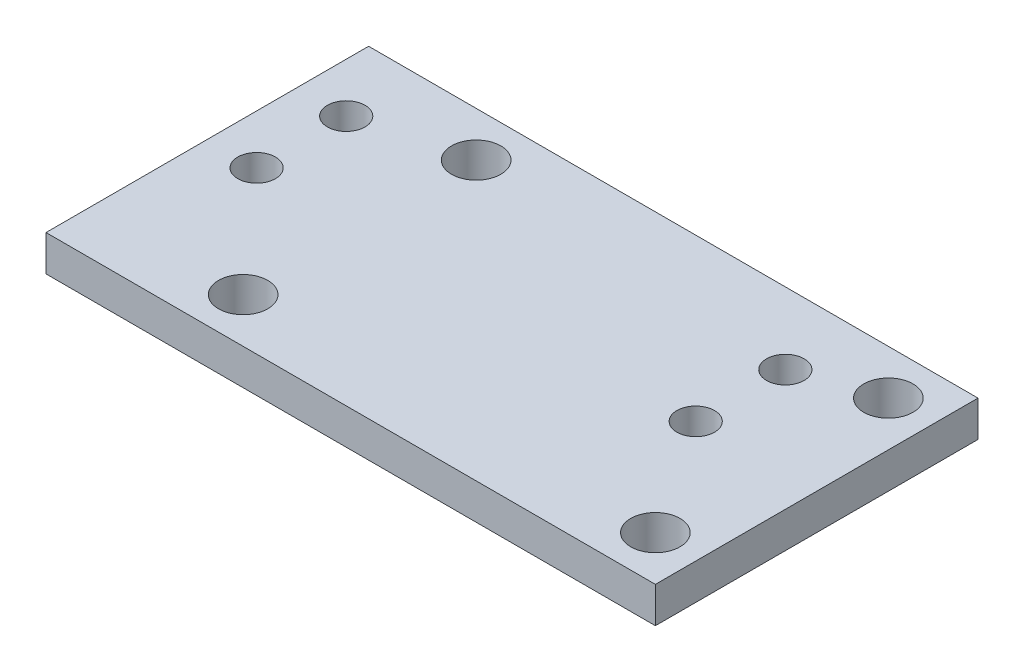
ISO-10303-21;
HEADER;
FILE_DESCRIPTION(('STEP AP214'),'2;1');
FILE_NAME('part.step','',(''),(''),'','','');
FILE_SCHEMA(('AUTOMOTIVE_DESIGN { 1 0 10303 214 1 1 1 1 }'));
ENDSEC;
DATA;
#1=APPLICATION_CONTEXT('core data for automotive mechanical design processes');
#2=APPLICATION_PROTOCOL_DEFINITION('international standard','automotive_design',2000,#1);
#3=PRODUCT_CONTEXT('',#1,'mechanical');
#4=PRODUCT('Part','Part','',(#3));
#5=PRODUCT_RELATED_PRODUCT_CATEGORY('part','',(#4));
#6=PRODUCT_DEFINITION_FORMATION('','',#4);
#7=PRODUCT_DEFINITION_CONTEXT('part definition',#1,'design');
#8=PRODUCT_DEFINITION('design','',#6,#7);
#9=PRODUCT_DEFINITION_SHAPE('','',#8);
#10=(LENGTH_UNIT() NAMED_UNIT(*) SI_UNIT(.MILLI.,.METRE.));
#11=(NAMED_UNIT(*) PLANE_ANGLE_UNIT() SI_UNIT($,.RADIAN.));
#12=(NAMED_UNIT(*) SI_UNIT($,.STERADIAN.) SOLID_ANGLE_UNIT());
#13=UNCERTAINTY_MEASURE_WITH_UNIT(LENGTH_MEASURE(1.E-05),#10,'distance_accuracy_value','');
#14=(GEOMETRIC_REPRESENTATION_CONTEXT(3) GLOBAL_UNCERTAINTY_ASSIGNED_CONTEXT((#13)) GLOBAL_UNIT_ASSIGNED_CONTEXT((#10,
#11,#12)) REPRESENTATION_CONTEXT('',''));
#15=CARTESIAN_POINT('',(0.,0.,0.));
#16=DIRECTION('',(0.,0.,1.));
#17=DIRECTION('',(1.,0.,0.));
#18=AXIS2_PLACEMENT_3D('',#15,#16,#17);
#19=CARTESIAN_POINT('',(0.,4.,0.));
#20=DIRECTION('',(0.,1.,0.));
#21=DIRECTION('',(0.,0.,1.));
#22=AXIS2_PLACEMENT_3D('',#19,#20,#21);
#23=PLANE('',#22);
#24=CARTESIAN_POINT('',(-41.4190774454018,4.,-24.4811588588684));
#25=DIRECTION('',(0.,1.,0.));
#26=DIRECTION('',(0.,0.,1.));
#27=AXIS2_PLACEMENT_3D('',#24,#25,#26);
#28=CIRCLE('',#27,2.1);
#29=CARTESIAN_POINT('',(-41.4190774454018,4.,-22.3811588588684));
#30=VERTEX_POINT('',#29);
#31=EDGE_CURVE('E195',#30,#30,#28,.T.);
#32=ORIENTED_EDGE('',*,*,#31,.F.);
#33=EDGE_LOOP('',(#32));
#34=FACE_BOUND('',#33,.T.);
#35=CARTESIAN_POINT('',(7.58092255459818,4.,-14.4811588588684));
#36=DIRECTION('',(0.,1.,0.));
#37=DIRECTION('',(0.,0.,1.));
#38=AXIS2_PLACEMENT_3D('',#35,#36,#37);
#39=CIRCLE('',#38,2.1);
#40=CARTESIAN_POINT('',(7.58092255459818,4.,-12.3811588588684));
#41=VERTEX_POINT('',#40);
#42=EDGE_CURVE('E211',#41,#41,#39,.T.);
#43=ORIENTED_EDGE('',*,*,#42,.F.);
#44=EDGE_LOOP('',(#43));
#45=FACE_BOUND('',#44,.T.);
#46=CARTESIAN_POINT('',(-29.9190774454018,4.,-1.48115885886842));
#47=DIRECTION('',(0.,1.,0.));
#48=DIRECTION('',(0.,0.,1.));
#49=AXIS2_PLACEMENT_3D('',#46,#47,#48);
#50=CIRCLE('',#49,2.75);
#51=CARTESIAN_POINT('',(-29.9190774454018,4.,1.26884114113158));
#52=VERTEX_POINT('',#51);
#53=EDGE_CURVE('E227',#52,#52,#50,.T.);
#54=ORIENTED_EDGE('',*,*,#53,.F.);
#55=EDGE_LOOP('',(#54));
#56=FACE_BOUND('',#55,.T.);
#57=CARTESIAN_POINT('',(-29.9190774454018,4.,-27.4811588588684));
#58=DIRECTION('',(0.,1.,0.));
#59=DIRECTION('',(0.,0.,1.));
#60=AXIS2_PLACEMENT_3D('',#57,#58,#59);
#61=CIRCLE('',#60,2.75);
#62=CARTESIAN_POINT('',(-29.9190774454018,4.,-24.7311588588684));
#63=VERTEX_POINT('',#62);
#64=EDGE_CURVE('E115',#63,#63,#61,.T.);
#65=ORIENTED_EDGE('',*,*,#64,.F.);
#66=EDGE_LOOP('',(#65));
#67=FACE_BOUND('',#66,.T.);
#68=DIRECTION('',(-1.,0.,0.));
#69=VECTOR('',#68,1.);
#70=CARTESIAN_POINT('',(-34.9190774454018,4.,-32.4811588588684));
#71=LINE('',#70,#69);
#72=CARTESIAN_POINT('',(21.0809225545982,4.,-32.4811588588684));
#73=VERTEX_POINT('',#72);
#74=CARTESIAN_POINT('',(-46.9190774454018,4.,-32.4811588588684));
#75=VERTEX_POINT('',#74);
#76=EDGE_CURVE('E61',#73,#75,#71,.T.);
#77=ORIENTED_EDGE('',*,*,#76,.T.);
#78=DIRECTION('',(0.,0.,1.));
#79=VECTOR('',#78,1.);
#80=CARTESIAN_POINT('',(-46.9190774454018,4.,-32.4811588588684));
#81=LINE('',#80,#79);
#82=CARTESIAN_POINT('',(-46.9190774454018,4.,3.51884114113159));
#83=VERTEX_POINT('',#82);
#84=EDGE_CURVE('E91',#75,#83,#81,.T.);
#85=ORIENTED_EDGE('',*,*,#84,.T.);
#86=DIRECTION('',(1.,0.,0.));
#87=VECTOR('',#86,1.);
#88=CARTESIAN_POINT('',(-46.9190774454018,4.,3.51884114113159));
#89=LINE('',#88,#87);
#90=CARTESIAN_POINT('',(21.0809225545982,4.,3.51884114113159));
#91=VERTEX_POINT('',#90);
#92=EDGE_CURVE('E95',#83,#91,#89,.T.);
#93=ORIENTED_EDGE('',*,*,#92,.T.);
#94=DIRECTION('',(0.,0.,-1.));
#95=VECTOR('',#94,1.);
#96=CARTESIAN_POINT('',(21.0809225545982,4.,-32.4811588588684));
#97=LINE('',#96,#95);
#98=EDGE_CURVE('E106',#91,#73,#97,.T.);
#99=ORIENTED_EDGE('',*,*,#98,.T.);
#100=EDGE_LOOP('',(#77,#85,#93,#99));
#101=FACE_BOUND('',#100,.T.);
#102=CARTESIAN_POINT('',(16.0809225545982,4.,-27.4811588588684));
#103=DIRECTION('',(0.,1.,0.));
#104=DIRECTION('',(0.,0.,1.));
#105=AXIS2_PLACEMENT_3D('',#102,#103,#104);
#106=CIRCLE('',#105,2.75);
#107=CARTESIAN_POINT('',(16.0809225545982,4.,-24.7311588588684));
#108=VERTEX_POINT('',#107);
#109=EDGE_CURVE('E235',#108,#108,#106,.T.);
#110=ORIENTED_EDGE('',*,*,#109,.F.);
#111=EDGE_LOOP('',(#110));
#112=FACE_BOUND('',#111,.T.);
#113=CARTESIAN_POINT('',(16.0809225545982,4.,-1.48115885886842));
#114=DIRECTION('',(0.,1.,0.));
#115=DIRECTION('',(0.,0.,1.));
#116=AXIS2_PLACEMENT_3D('',#113,#114,#115);
#117=CIRCLE('',#116,2.75);
#118=CARTESIAN_POINT('',(16.0809225545982,4.,1.26884114113157));
#119=VERTEX_POINT('',#118);
#120=EDGE_CURVE('E219',#119,#119,#117,.T.);
#121=ORIENTED_EDGE('',*,*,#120,.F.);
#122=EDGE_LOOP('',(#121));
#123=FACE_BOUND('',#122,.T.);
#124=CARTESIAN_POINT('',(7.58092255459818,4.,-24.4811588588684));
#125=DIRECTION('',(0.,1.,0.));
#126=DIRECTION('',(0.,0.,1.));
#127=AXIS2_PLACEMENT_3D('',#124,#125,#126);
#128=CIRCLE('',#127,2.1);
#129=CARTESIAN_POINT('',(7.58092255459818,4.,-22.3811588588684));
#130=VERTEX_POINT('',#129);
#131=EDGE_CURVE('E203',#130,#130,#128,.T.);
#132=ORIENTED_EDGE('',*,*,#131,.F.);
#133=EDGE_LOOP('',(#132));
#134=FACE_BOUND('',#133,.T.);
#135=CARTESIAN_POINT('',(-41.4190774454018,4.,-14.4811588588684));
#136=DIRECTION('',(0.,1.,0.));
#137=DIRECTION('',(0.,0.,1.));
#138=AXIS2_PLACEMENT_3D('',#135,#136,#137);
#139=CIRCLE('',#138,2.1);
#140=CARTESIAN_POINT('',(-41.4190774454018,4.,-12.3811588588684));
#141=VERTEX_POINT('',#140);
#142=EDGE_CURVE('E184',#141,#141,#139,.T.);
#143=ORIENTED_EDGE('',*,*,#142,.F.);
#144=EDGE_LOOP('',(#143));
#145=FACE_BOUND('',#144,.T.);
#146=ADVANCED_FACE('F43',(#34,#45,#56,#67,#101,#112,#123,#134,#145),#23,.T.);
#147=CARTESIAN_POINT('',(0.,0.,0.));
#148=DIRECTION('',(0.,1.,0.));
#149=DIRECTION('',(0.,0.,1.));
#150=AXIS2_PLACEMENT_3D('',#147,#148,#149);
#151=PLANE('',#150);
#152=DIRECTION('',(0.,0.,1.));
#153=VECTOR('',#152,1.);
#154=CARTESIAN_POINT('',(-46.9190774454018,0.,-32.4811588588684));
#155=LINE('',#154,#153);
#156=CARTESIAN_POINT('',(-46.9190774454018,0.,-32.4811588588684));
#157=VERTEX_POINT('',#156);
#158=CARTESIAN_POINT('',(-46.9190774454018,0.,3.51884114113159));
#159=VERTEX_POINT('',#158);
#160=EDGE_CURVE('E100',#157,#159,#155,.T.);
#161=ORIENTED_EDGE('',*,*,#160,.F.);
#162=DIRECTION('',(-1.,0.,0.));
#163=VECTOR('',#162,1.);
#164=CARTESIAN_POINT('',(-34.9190774454018,0.,-32.4811588588684));
#165=LINE('',#164,#163);
#166=CARTESIAN_POINT('',(21.0809225545982,0.,-32.4811588588684));
#167=VERTEX_POINT('',#166);
#168=EDGE_CURVE('E120',#167,#157,#165,.T.);
#169=ORIENTED_EDGE('',*,*,#168,.F.);
#170=DIRECTION('',(0.,0.,-1.));
#171=VECTOR('',#170,1.);
#172=CARTESIAN_POINT('',(21.0809225545982,0.,-32.4811588588684));
#173=LINE('',#172,#171);
#174=CARTESIAN_POINT('',(21.0809225545982,0.,3.51884114113159));
#175=VERTEX_POINT('',#174);
#176=EDGE_CURVE('E85',#175,#167,#173,.T.);
#177=ORIENTED_EDGE('',*,*,#176,.F.);
#178=DIRECTION('',(1.,0.,0.));
#179=VECTOR('',#178,1.);
#180=CARTESIAN_POINT('',(-34.9190774454018,0.,3.51884114113159));
#181=LINE('',#180,#179);
#182=EDGE_CURVE('E78',#159,#175,#181,.T.);
#183=ORIENTED_EDGE('',*,*,#182,.F.);
#184=EDGE_LOOP('',(#161,#169,#177,#183));
#185=FACE_BOUND('',#184,.T.);
#186=CARTESIAN_POINT('',(-29.9190774454018,0.,-27.4811588588684));
#187=DIRECTION('',(0.,1.,0.));
#188=DIRECTION('',(0.,0.,1.));
#189=AXIS2_PLACEMENT_3D('',#186,#187,#188);
#190=CIRCLE('',#189,2.75);
#191=CARTESIAN_POINT('',(-29.9190774454018,0.,-24.7311588588684));
#192=VERTEX_POINT('',#191);
#193=EDGE_CURVE('E239',#192,#192,#190,.T.);
#194=ORIENTED_EDGE('',*,*,#193,.T.);
#195=EDGE_LOOP('',(#194));
#196=FACE_BOUND('',#195,.T.);
#197=CARTESIAN_POINT('',(16.0809225545982,0.,-27.4811588588684));
#198=DIRECTION('',(0.,1.,0.));
#199=DIRECTION('',(0.,0.,1.));
#200=AXIS2_PLACEMENT_3D('',#197,#198,#199);
#201=CIRCLE('',#200,2.75);
#202=CARTESIAN_POINT('',(16.0809225545982,0.,-24.7311588588684));
#203=VERTEX_POINT('',#202);
#204=EDGE_CURVE('E231',#203,#203,#201,.T.);
#205=ORIENTED_EDGE('',*,*,#204,.T.);
#206=EDGE_LOOP('',(#205));
#207=FACE_BOUND('',#206,.T.);
#208=CARTESIAN_POINT('',(-29.9190774454018,0.,-1.48115885886842));
#209=DIRECTION('',(0.,1.,0.));
#210=DIRECTION('',(0.,0.,1.));
#211=AXIS2_PLACEMENT_3D('',#208,#209,#210);
#212=CIRCLE('',#211,2.75);
#213=CARTESIAN_POINT('',(-29.9190774454018,0.,1.26884114113158));
#214=VERTEX_POINT('',#213);
#215=EDGE_CURVE('E223',#214,#214,#212,.T.);
#216=ORIENTED_EDGE('',*,*,#215,.T.);
#217=EDGE_LOOP('',(#216));
#218=FACE_BOUND('',#217,.T.);
#219=CARTESIAN_POINT('',(16.0809225545982,0.,-1.48115885886842));
#220=DIRECTION('',(0.,1.,0.));
#221=DIRECTION('',(0.,0.,1.));
#222=AXIS2_PLACEMENT_3D('',#219,#220,#221);
#223=CIRCLE('',#222,2.75);
#224=CARTESIAN_POINT('',(16.0809225545982,0.,1.26884114113157));
#225=VERTEX_POINT('',#224);
#226=EDGE_CURVE('E215',#225,#225,#223,.T.);
#227=ORIENTED_EDGE('',*,*,#226,.T.);
#228=EDGE_LOOP('',(#227));
#229=FACE_BOUND('',#228,.T.);
#230=CARTESIAN_POINT('',(7.58092255459818,0.,-14.4811588588684));
#231=DIRECTION('',(0.,1.,0.));
#232=DIRECTION('',(0.,0.,1.));
#233=AXIS2_PLACEMENT_3D('',#230,#231,#232);
#234=CIRCLE('',#233,2.1);
#235=CARTESIAN_POINT('',(7.58092255459818,0.,-12.3811588588684));
#236=VERTEX_POINT('',#235);
#237=EDGE_CURVE('E207',#236,#236,#234,.T.);
#238=ORIENTED_EDGE('',*,*,#237,.T.);
#239=EDGE_LOOP('',(#238));
#240=FACE_BOUND('',#239,.T.);
#241=CARTESIAN_POINT('',(7.58092255459818,0.,-24.4811588588684));
#242=DIRECTION('',(0.,1.,0.));
#243=DIRECTION('',(0.,0.,1.));
#244=AXIS2_PLACEMENT_3D('',#241,#242,#243);
#245=CIRCLE('',#244,2.1);
#246=CARTESIAN_POINT('',(7.58092255459818,0.,-22.3811588588684));
#247=VERTEX_POINT('',#246);
#248=EDGE_CURVE('E199',#247,#247,#245,.T.);
#249=ORIENTED_EDGE('',*,*,#248,.T.);
#250=EDGE_LOOP('',(#249));
#251=FACE_BOUND('',#250,.T.);
#252=CARTESIAN_POINT('',(-41.4190774454018,0.,-24.4811588588684));
#253=DIRECTION('',(0.,1.,0.));
#254=DIRECTION('',(0.,0.,1.));
#255=AXIS2_PLACEMENT_3D('',#252,#253,#254);
#256=CIRCLE('',#255,2.1);
#257=CARTESIAN_POINT('',(-41.4190774454018,0.,-22.3811588588684));
#258=VERTEX_POINT('',#257);
#259=EDGE_CURVE('E192',#258,#258,#256,.T.);
#260=ORIENTED_EDGE('',*,*,#259,.T.);
#261=EDGE_LOOP('',(#260));
#262=FACE_BOUND('',#261,.T.);
#263=CARTESIAN_POINT('',(-41.4190774454018,0.,-14.4811588588684));
#264=DIRECTION('',(0.,1.,0.));
#265=DIRECTION('',(0.,0.,1.));
#266=AXIS2_PLACEMENT_3D('',#263,#264,#265);
#267=CIRCLE('',#266,2.1);
#268=CARTESIAN_POINT('',(-41.4190774454018,0.,-12.3811588588684));
#269=VERTEX_POINT('',#268);
#270=EDGE_CURVE('E187',#269,#269,#267,.T.);
#271=ORIENTED_EDGE('',*,*,#270,.T.);
#272=EDGE_LOOP('',(#271));
#273=FACE_BOUND('',#272,.T.);
#274=ADVANCED_FACE('F129',(#185,#196,#207,#218,#229,#240,#251,#262,#273),#151,.F.);
#275=CARTESIAN_POINT('',(-46.9190774454018,4.,-32.4811588588684));
#276=DIRECTION('',(1.,0.,0.));
#277=DIRECTION('',(0.,0.,-1.));
#278=AXIS2_PLACEMENT_3D('',#275,#276,#277);
#279=PLANE('',#278);
#280=ORIENTED_EDGE('',*,*,#160,.T.);
#281=DIRECTION('',(0.,-1.,0.));
#282=VECTOR('',#281,1.);
#283=CARTESIAN_POINT('',(-46.9190774454018,4.,3.51884114113159));
#284=LINE('',#283,#282);
#285=EDGE_CURVE('E53',#83,#159,#284,.T.);
#286=ORIENTED_EDGE('',*,*,#285,.F.);
#287=ORIENTED_EDGE('',*,*,#84,.F.);
#288=DIRECTION('',(0.,-1.,0.));
#289=VECTOR('',#288,1.);
#290=CARTESIAN_POINT('',(-46.9190774454018,4.,-32.4811588588684));
#291=LINE('',#290,#289);
#292=EDGE_CURVE('E11',#75,#157,#291,.T.);
#293=ORIENTED_EDGE('',*,*,#292,.T.);
#294=EDGE_LOOP('',(#280,#286,#287,#293));
#295=FACE_BOUND('',#294,.T.);
#296=ADVANCED_FACE('F45',(#295),#279,.F.);
#297=CARTESIAN_POINT('',(-34.9190774454018,4.,3.51884114113159));
#298=DIRECTION('',(0.,0.,-1.));
#299=DIRECTION('',(-1.,0.,0.));
#300=AXIS2_PLACEMENT_3D('',#297,#298,#299);
#301=PLANE('',#300);
#302=ORIENTED_EDGE('',*,*,#182,.T.);
#303=DIRECTION('',(0.,-1.,0.));
#304=VECTOR('',#303,1.);
#305=CARTESIAN_POINT('',(21.0809225545982,4.,3.51884114113159));
#306=LINE('',#305,#304);
#307=EDGE_CURVE('E102',#91,#175,#306,.T.);
#308=ORIENTED_EDGE('',*,*,#307,.F.);
#309=ORIENTED_EDGE('',*,*,#92,.F.);
#310=ORIENTED_EDGE('',*,*,#285,.T.);
#311=EDGE_LOOP('',(#302,#308,#309,#310));
#312=FACE_BOUND('',#311,.T.);
#313=ADVANCED_FACE('F103',(#312),#301,.F.);
#314=CARTESIAN_POINT('',(21.0809225545982,4.,-32.4811588588684));
#315=DIRECTION('',(-1.,0.,0.));
#316=DIRECTION('',(0.,0.,1.));
#317=AXIS2_PLACEMENT_3D('',#314,#315,#316);
#318=PLANE('',#317);
#319=ORIENTED_EDGE('',*,*,#176,.T.);
#320=DIRECTION('',(0.,-1.,0.));
#321=VECTOR('',#320,1.);
#322=CARTESIAN_POINT('',(21.0809225545982,4.,-32.4811588588684));
#323=LINE('',#322,#321);
#324=EDGE_CURVE('E109',#73,#167,#323,.T.);
#325=ORIENTED_EDGE('',*,*,#324,.F.);
#326=ORIENTED_EDGE('',*,*,#98,.F.);
#327=ORIENTED_EDGE('',*,*,#307,.T.);
#328=EDGE_LOOP('',(#319,#325,#326,#327));
#329=FACE_BOUND('',#328,.T.);
#330=ADVANCED_FACE('F126',(#329),#318,.F.);
#331=CARTESIAN_POINT('',(-34.9190774454018,4.,-32.4811588588684));
#332=DIRECTION('',(0.,0.,1.));
#333=DIRECTION('',(1.,0.,0.));
#334=AXIS2_PLACEMENT_3D('',#331,#332,#333);
#335=PLANE('',#334);
#336=ORIENTED_EDGE('',*,*,#168,.T.);
#337=ORIENTED_EDGE('',*,*,#292,.F.);
#338=ORIENTED_EDGE('',*,*,#76,.F.);
#339=ORIENTED_EDGE('',*,*,#324,.T.);
#340=EDGE_LOOP('',(#336,#337,#338,#339));
#341=FACE_BOUND('',#340,.T.);
#342=ADVANCED_FACE('F131',(#341),#335,.F.);
#343=CARTESIAN_POINT('',(-29.9190774454018,4.,-27.4811588588684));
#344=DIRECTION('',(0.,-1.,0.));
#345=DIRECTION('',(0.,0.,-1.));
#346=AXIS2_PLACEMENT_3D('',#343,#344,#345);
#347=CYLINDRICAL_SURFACE('',#346,2.75);
#348=ORIENTED_EDGE('',*,*,#64,.T.);
#349=EDGE_LOOP('',(#348));
#350=FACE_BOUND('',#349,.T.);
#351=ORIENTED_EDGE('',*,*,#193,.F.);
#352=EDGE_LOOP('',(#351));
#353=FACE_BOUND('',#352,.T.);
#354=ADVANCED_FACE('F133',(#350,#353),#347,.F.);
#355=CARTESIAN_POINT('',(16.0809225545982,4.,-27.4811588588684));
#356=DIRECTION('',(0.,-1.,0.));
#357=DIRECTION('',(0.,0.,-1.));
#358=AXIS2_PLACEMENT_3D('',#355,#356,#357);
#359=CYLINDRICAL_SURFACE('',#358,2.75);
#360=ORIENTED_EDGE('',*,*,#109,.T.);
#361=EDGE_LOOP('',(#360));
#362=FACE_BOUND('',#361,.T.);
#363=ORIENTED_EDGE('',*,*,#204,.F.);
#364=EDGE_LOOP('',(#363));
#365=FACE_BOUND('',#364,.T.);
#366=ADVANCED_FACE('F139',(#362,#365),#359,.F.);
#367=CARTESIAN_POINT('',(-29.9190774454018,4.,-1.48115885886842));
#368=DIRECTION('',(0.,-1.,0.));
#369=DIRECTION('',(0.,0.,-1.));
#370=AXIS2_PLACEMENT_3D('',#367,#368,#369);
#371=CYLINDRICAL_SURFACE('',#370,2.75);
#372=ORIENTED_EDGE('',*,*,#53,.T.);
#373=EDGE_LOOP('',(#372));
#374=FACE_BOUND('',#373,.T.);
#375=ORIENTED_EDGE('',*,*,#215,.F.);
#376=EDGE_LOOP('',(#375));
#377=FACE_BOUND('',#376,.T.);
#378=ADVANCED_FACE('F155',(#374,#377),#371,.F.);
#379=CARTESIAN_POINT('',(16.0809225545982,4.,-1.48115885886842));
#380=DIRECTION('',(0.,-1.,0.));
#381=DIRECTION('',(0.,0.,-1.));
#382=AXIS2_PLACEMENT_3D('',#379,#380,#381);
#383=CYLINDRICAL_SURFACE('',#382,2.75);
#384=ORIENTED_EDGE('',*,*,#120,.T.);
#385=EDGE_LOOP('',(#384));
#386=FACE_BOUND('',#385,.T.);
#387=ORIENTED_EDGE('',*,*,#226,.F.);
#388=EDGE_LOOP('',(#387));
#389=FACE_BOUND('',#388,.T.);
#390=ADVANCED_FACE('F159',(#386,#389),#383,.F.);
#391=CARTESIAN_POINT('',(7.58092255459818,4.,-14.4811588588684));
#392=DIRECTION('',(0.,-1.,0.));
#393=DIRECTION('',(0.,0.,-1.));
#394=AXIS2_PLACEMENT_3D('',#391,#392,#393);
#395=CYLINDRICAL_SURFACE('',#394,2.1);
#396=ORIENTED_EDGE('',*,*,#42,.T.);
#397=EDGE_LOOP('',(#396));
#398=FACE_BOUND('',#397,.T.);
#399=ORIENTED_EDGE('',*,*,#237,.F.);
#400=EDGE_LOOP('',(#399));
#401=FACE_BOUND('',#400,.T.);
#402=ADVANCED_FACE('F163',(#398,#401),#395,.F.);
#403=CARTESIAN_POINT('',(7.58092255459818,4.,-24.4811588588684));
#404=DIRECTION('',(0.,-1.,0.));
#405=DIRECTION('',(0.,0.,-1.));
#406=AXIS2_PLACEMENT_3D('',#403,#404,#405);
#407=CYLINDRICAL_SURFACE('',#406,2.1);
#408=ORIENTED_EDGE('',*,*,#131,.T.);
#409=EDGE_LOOP('',(#408));
#410=FACE_BOUND('',#409,.T.);
#411=ORIENTED_EDGE('',*,*,#248,.F.);
#412=EDGE_LOOP('',(#411));
#413=FACE_BOUND('',#412,.T.);
#414=ADVANCED_FACE('F167',(#410,#413),#407,.F.);
#415=CARTESIAN_POINT('',(-41.4190774454018,4.,-24.4811588588684));
#416=DIRECTION('',(0.,-1.,0.));
#417=DIRECTION('',(0.,0.,-1.));
#418=AXIS2_PLACEMENT_3D('',#415,#416,#417);
#419=CYLINDRICAL_SURFACE('',#418,2.1);
#420=ORIENTED_EDGE('',*,*,#31,.T.);
#421=EDGE_LOOP('',(#420));
#422=FACE_BOUND('',#421,.T.);
#423=ORIENTED_EDGE('',*,*,#259,.F.);
#424=EDGE_LOOP('',(#423));
#425=FACE_BOUND('',#424,.T.);
#426=ADVANCED_FACE('F171',(#422,#425),#419,.F.);
#427=CARTESIAN_POINT('',(-41.4190774454018,4.,-14.4811588588684));
#428=DIRECTION('',(0.,-1.,0.));
#429=DIRECTION('',(0.,0.,-1.));
#430=AXIS2_PLACEMENT_3D('',#427,#428,#429);
#431=CYLINDRICAL_SURFACE('',#430,2.1);
#432=ORIENTED_EDGE('',*,*,#142,.T.);
#433=EDGE_LOOP('',(#432));
#434=FACE_BOUND('',#433,.T.);
#435=ORIENTED_EDGE('',*,*,#270,.F.);
#436=EDGE_LOOP('',(#435));
#437=FACE_BOUND('',#436,.T.);
#438=ADVANCED_FACE('F175',(#434,#437),#431,.F.);
#439=CLOSED_SHELL('',(#146,#274,#296,#313,#330,#342,#354,#366,#378,#390,#402,#414,#426,#438));
#440=MANIFOLD_SOLID_BREP('B2',#439);
#441=ADVANCED_BREP_SHAPE_REPRESENTATION('',(#18,#440),#14);
#442=SHAPE_DEFINITION_REPRESENTATION(#9,#441);
ENDSEC;
END-ISO-10303-21;
